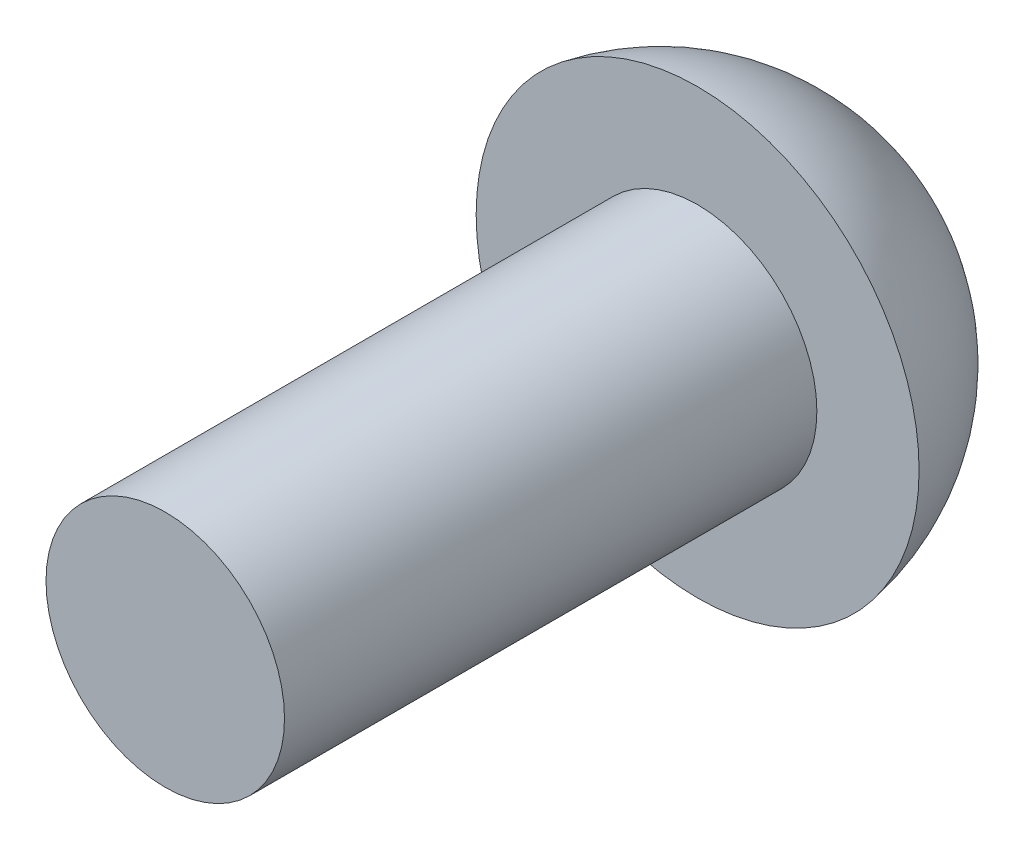
ISO-10303-21;
HEADER;
FILE_DESCRIPTION(('STEP AP214'),'2;1');
FILE_NAME('part.step','',(''),(''),'','','');
FILE_SCHEMA(('AUTOMOTIVE_DESIGN { 1 0 10303 214 1 1 1 1 }'));
ENDSEC;
DATA;
#1=APPLICATION_CONTEXT('core data for automotive mechanical design processes');
#2=APPLICATION_PROTOCOL_DEFINITION('international standard','automotive_design',2000,#1);
#3=PRODUCT_CONTEXT('',#1,'mechanical');
#4=PRODUCT('Part','Part','',(#3));
#5=PRODUCT_RELATED_PRODUCT_CATEGORY('part','',(#4));
#6=PRODUCT_DEFINITION_FORMATION('','',#4);
#7=PRODUCT_DEFINITION_CONTEXT('part definition',#1,'design');
#8=PRODUCT_DEFINITION('design','',#6,#7);
#9=PRODUCT_DEFINITION_SHAPE('','',#8);
#10=(LENGTH_UNIT() NAMED_UNIT(*) SI_UNIT(.MILLI.,.METRE.));
#11=(NAMED_UNIT(*) PLANE_ANGLE_UNIT() SI_UNIT($,.RADIAN.));
#12=(NAMED_UNIT(*) SI_UNIT($,.STERADIAN.) SOLID_ANGLE_UNIT());
#13=UNCERTAINTY_MEASURE_WITH_UNIT(LENGTH_MEASURE(1.E-05),#10,'distance_accuracy_value','');
#14=(GEOMETRIC_REPRESENTATION_CONTEXT(3) GLOBAL_UNCERTAINTY_ASSIGNED_CONTEXT((#13)) GLOBAL_UNIT_ASSIGNED_CONTEXT((#10,
#11,#12)) REPRESENTATION_CONTEXT('',''));
#15=CARTESIAN_POINT('',(0.,0.,0.));
#16=DIRECTION('',(0.,0.,1.));
#17=DIRECTION('',(1.,0.,0.));
#18=AXIS2_PLACEMENT_3D('',#15,#16,#17);
#19=CARTESIAN_POINT('',(0.,0.,-5.90665454545455));
#20=DIRECTION('',(0.,0.,1.));
#21=DIRECTION('',(0.,1.,0.));
#22=AXIS2_PLACEMENT_3D('',#19,#20,#21);
#23=SPHERICAL_SURFACE('',#22,2.67854545454545);
#24=CARTESIAN_POINT('',(0.,0.,-6.35));
#25=DIRECTION('',(0.,0.,1.));
#26=DIRECTION('',(0.,-1.,0.));
#27=AXIS2_PLACEMENT_3D('',#24,#25,#26);
#28=CIRCLE('',#27,2.6416);
#29=CARTESIAN_POINT('',(0.,-2.6416,-6.35));
#30=VERTEX_POINT('',#29);
#31=EDGE_CURVE('E10',#30,#30,#28,.T.);
#32=ORIENTED_EDGE('',*,*,#31,.F.);
#33=EDGE_LOOP('',(#32));
#34=FACE_BOUND('',#33,.T.);
#35=ADVANCED_FACE('F358',(#34),#23,.T.);
#36=CARTESIAN_POINT('',(0.,1.4224,-6.35));
#37=DIRECTION('',(0.,0.,-1.));
#38=DIRECTION('',(0.,1.,0.));
#39=AXIS2_PLACEMENT_3D('',#36,#37,#38);
#40=PLANE('',#39);
#41=CARTESIAN_POINT('',(0.,0.,-6.35));
#42=DIRECTION('',(0.,0.,1.));
#43=DIRECTION('',(0.,-1.,0.));
#44=AXIS2_PLACEMENT_3D('',#41,#42,#43);
#45=CIRCLE('',#44,1.4224);
#46=CARTESIAN_POINT('',(0.,-1.4224,-6.35));
#47=VERTEX_POINT('',#46);
#48=EDGE_CURVE('E364',#47,#47,#45,.T.);
#49=ORIENTED_EDGE('',*,*,#48,.F.);
#50=EDGE_LOOP('',(#49));
#51=FACE_BOUND('',#50,.T.);
#52=ORIENTED_EDGE('',*,*,#31,.T.);
#53=EDGE_LOOP('',(#52));
#54=FACE_BOUND('',#53,.T.);
#55=ADVANCED_FACE('F379',(#51,#54),#40,.F.);
#56=CARTESIAN_POINT('',(0.,0.,0.));
#57=DIRECTION('',(0.,0.,1.));
#58=DIRECTION('',(0.,-1.,0.));
#59=AXIS2_PLACEMENT_3D('',#56,#57,#58);
#60=CYLINDRICAL_SURFACE('',#59,1.4224);
#61=CARTESIAN_POINT('',(0.,0.,0.));
#62=DIRECTION('',(0.,0.,1.));
#63=DIRECTION('',(0.,-1.,0.));
#64=AXIS2_PLACEMENT_3D('',#61,#62,#63);
#65=CIRCLE('',#64,1.4224);
#66=CARTESIAN_POINT('',(0.,-1.4224,0.));
#67=VERTEX_POINT('',#66);
#68=EDGE_CURVE('E368',#67,#67,#65,.T.);
#69=ORIENTED_EDGE('',*,*,#68,.F.);
#70=EDGE_LOOP('',(#69));
#71=FACE_BOUND('',#70,.T.);
#72=ORIENTED_EDGE('',*,*,#48,.T.);
#73=EDGE_LOOP('',(#72));
#74=FACE_BOUND('',#73,.T.);
#75=ADVANCED_FACE('F377',(#71,#74),#60,.T.);
#76=CARTESIAN_POINT('',(0.,0.,0.));
#77=DIRECTION('',(0.,0.,-1.));
#78=DIRECTION('',(0.,1.,0.));
#79=AXIS2_PLACEMENT_3D('',#76,#77,#78);
#80=PLANE('',#79);
#81=ORIENTED_EDGE('',*,*,#68,.T.);
#82=EDGE_LOOP('',(#81));
#83=FACE_BOUND('',#82,.T.);
#84=ADVANCED_FACE('F375',(#83),#80,.F.);
#85=CLOSED_SHELL('',(#35,#55,#75,#84));
#86=MANIFOLD_SOLID_BREP('B2',#85);
#87=ADVANCED_BREP_SHAPE_REPRESENTATION('',(#18,#86),#14);
#88=SHAPE_DEFINITION_REPRESENTATION(#9,#87);
ENDSEC;
END-ISO-10303-21;
